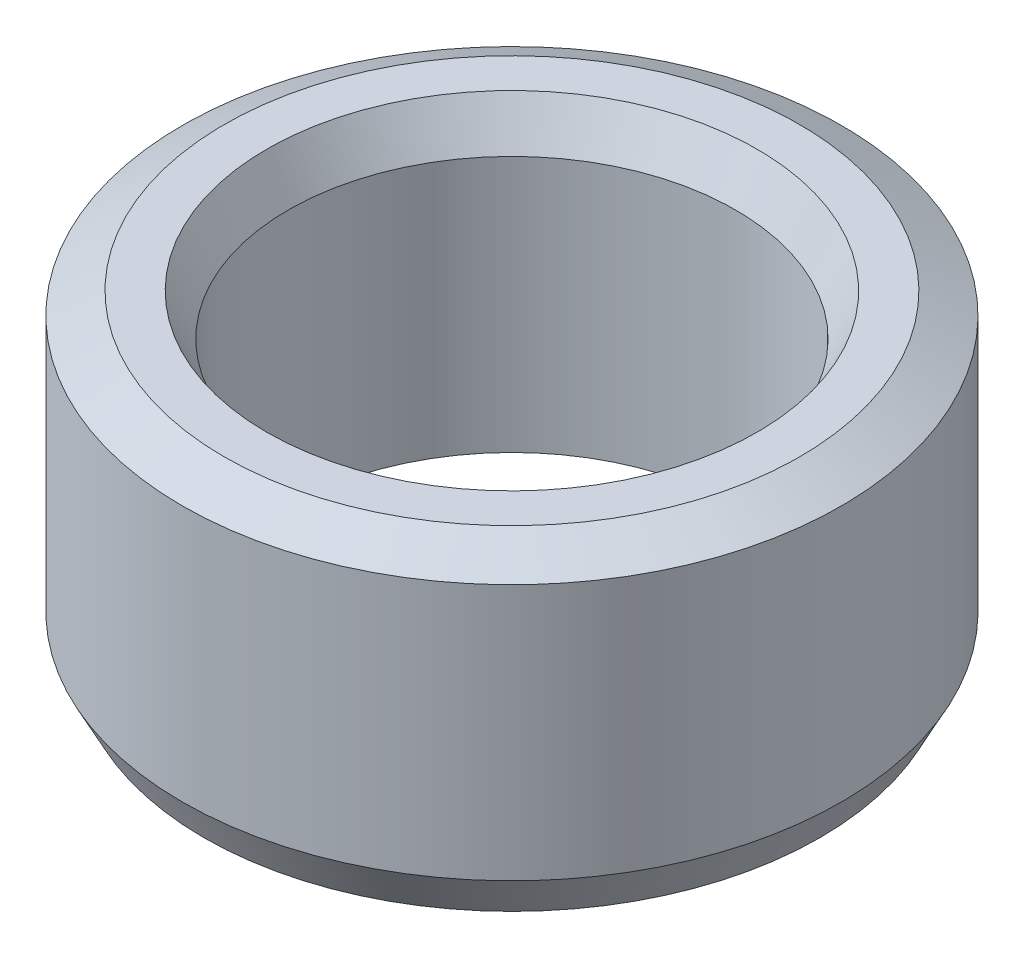
ISO-10303-21;
HEADER;
FILE_DESCRIPTION(('STEP AP214'),'2;1');
FILE_NAME('part.step','',(''),(''),'','','');
FILE_SCHEMA(('AUTOMOTIVE_DESIGN { 1 0 10303 214 1 1 1 1 }'));
ENDSEC;
DATA;
#1=APPLICATION_CONTEXT('core data for automotive mechanical design processes');
#2=APPLICATION_PROTOCOL_DEFINITION('international standard','automotive_design',2000,#1);
#3=PRODUCT_CONTEXT('',#1,'mechanical');
#4=PRODUCT('Part','Part','',(#3));
#5=PRODUCT_RELATED_PRODUCT_CATEGORY('part','',(#4));
#6=PRODUCT_DEFINITION_FORMATION('','',#4);
#7=PRODUCT_DEFINITION_CONTEXT('part definition',#1,'design');
#8=PRODUCT_DEFINITION('design','',#6,#7);
#9=PRODUCT_DEFINITION_SHAPE('','',#8);
#10=(LENGTH_UNIT() NAMED_UNIT(*) SI_UNIT(.MILLI.,.METRE.));
#11=(NAMED_UNIT(*) PLANE_ANGLE_UNIT() SI_UNIT($,.RADIAN.));
#12=(NAMED_UNIT(*) SI_UNIT($,.STERADIAN.) SOLID_ANGLE_UNIT());
#13=UNCERTAINTY_MEASURE_WITH_UNIT(LENGTH_MEASURE(1.E-05),#10,'distance_accuracy_value','');
#14=(GEOMETRIC_REPRESENTATION_CONTEXT(3) GLOBAL_UNCERTAINTY_ASSIGNED_CONTEXT((#13)) GLOBAL_UNIT_ASSIGNED_CONTEXT((#10,
#11,#12)) REPRESENTATION_CONTEXT('',''));
#15=CARTESIAN_POINT('',(0.,0.,0.));
#16=DIRECTION('',(0.,0.,1.));
#17=DIRECTION('',(1.,0.,0.));
#18=AXIS2_PLACEMENT_3D('',#15,#16,#17);
#19=CARTESIAN_POINT('',(0.,58.2230854384388,0.));
#20=DIRECTION('',(0.,-1.,0.));
#21=DIRECTION('',(0.,0.,-1.));
#22=AXIS2_PLACEMENT_3D('',#19,#20,#21);
#23=CYLINDRICAL_SURFACE('',#22,60.);
#24=CARTESIAN_POINT('',(0.,7.60752292098332,0.));
#25=DIRECTION('',(0.,1.,0.));
#26=DIRECTION('',(0.,0.,1.));
#27=AXIS2_PLACEMENT_3D('',#24,#25,#26);
#28=CIRCLE('',#27,60.);
#29=CARTESIAN_POINT('',(0.,7.60752292098332,60.));
#30=VERTEX_POINT('',#29);
#31=EDGE_CURVE('E10',#30,#30,#28,.T.);
#32=ORIENTED_EDGE('',*,*,#31,.T.);
#33=EDGE_LOOP('',(#32));
#34=FACE_BOUND('',#33,.T.);
#35=CARTESIAN_POINT('',(0.,54.2883937381654,0.));
#36=DIRECTION('',(0.,1.,0.));
#37=DIRECTION('',(0.,0.,1.));
#38=AXIS2_PLACEMENT_3D('',#35,#36,#37);
#39=CIRCLE('',#38,60.);
#40=CARTESIAN_POINT('',(0.,54.2883937381654,60.));
#41=VERTEX_POINT('',#40);
#42=EDGE_CURVE('E50',#41,#41,#39,.F.);
#43=ORIENTED_EDGE('',*,*,#42,.T.);
#44=EDGE_LOOP('',(#43));
#45=FACE_BOUND('',#44,.T.);
#46=ADVANCED_FACE('F39',(#34,#45),#23,.T.);
#47=CARTESIAN_POINT('',(0.,58.2230854384388,0.));
#48=DIRECTION('',(0.,1.,0.));
#49=DIRECTION('',(0.,0.,1.));
#50=AXIS2_PLACEMENT_3D('',#47,#48,#49);
#51=PLANE('',#50);
#52=CARTESIAN_POINT('',(0.,58.2230854384388,0.));
#53=DIRECTION('',(0.,1.,0.));
#54=DIRECTION('',(0.,0.,1.));
#55=AXIS2_PLACEMENT_3D('',#52,#53,#54);
#56=CIRCLE('',#55,44.6376050053237);
#57=CARTESIAN_POINT('',(0.,58.2230854384388,44.6376050053237));
#58=VERTEX_POINT('',#57);
#59=EDGE_CURVE('E58',#58,#58,#56,.F.);
#60=ORIENTED_EDGE('',*,*,#59,.T.);
#61=EDGE_LOOP('',(#60));
#62=FACE_BOUND('',#61,.T.);
#63=CARTESIAN_POINT('',(0.,58.2230854384388,0.));
#64=DIRECTION('',(0.,1.,0.));
#65=DIRECTION('',(0.,0.,1.));
#66=AXIS2_PLACEMENT_3D('',#63,#64,#65);
#67=CIRCLE('',#66,52.3924770790166);
#68=CARTESIAN_POINT('',(0.,58.2230854384388,52.3924770790166));
#69=VERTEX_POINT('',#68);
#70=EDGE_CURVE('E61',#69,#69,#67,.T.);
#71=ORIENTED_EDGE('',*,*,#70,.T.);
#72=EDGE_LOOP('',(#71));
#73=FACE_BOUND('',#72,.T.);
#74=ADVANCED_FACE('F88',(#62,#73),#51,.T.);
#75=CARTESIAN_POINT('',(0.,0.,0.));
#76=DIRECTION('',(0.,1.,0.));
#77=DIRECTION('',(0.,0.,1.));
#78=AXIS2_PLACEMENT_3D('',#75,#76,#77);
#79=PLANE('',#78);
#80=CARTESIAN_POINT('',(0.,0.,0.));
#81=DIRECTION('',(0.,1.,0.));
#82=DIRECTION('',(0.,0.,1.));
#83=AXIS2_PLACEMENT_3D('',#80,#81,#82);
#84=CIRCLE('',#83,48.3104362260336);
#85=CARTESIAN_POINT('',(0.,0.,48.3104362260336));
#86=VERTEX_POINT('',#85);
#87=EDGE_CURVE('E51',#86,#86,#84,.T.);
#88=ORIENTED_EDGE('',*,*,#87,.T.);
#89=EDGE_LOOP('',(#88));
#90=FACE_BOUND('',#89,.T.);
#91=CARTESIAN_POINT('',(0.,0.,0.));
#92=DIRECTION('',(0.,1.,0.));
#93=DIRECTION('',(0.,0.,1.));
#94=AXIS2_PLACEMENT_3D('',#91,#92,#93);
#95=CIRCLE('',#94,56.0653082997265);
#96=CARTESIAN_POINT('',(0.,0.,56.0653082997265));
#97=VERTEX_POINT('',#96);
#98=EDGE_CURVE('E54',#97,#97,#95,.F.);
#99=ORIENTED_EDGE('',*,*,#98,.T.);
#100=EDGE_LOOP('',(#99));
#101=FACE_BOUND('',#100,.T.);
#102=ADVANCED_FACE('F83',(#90,#101),#79,.F.);
#103=CARTESIAN_POINT('',(0.,58.2230854384388,0.));
#104=DIRECTION('',(0.,-1.,0.));
#105=DIRECTION('',(0.,0.,-1.));
#106=AXIS2_PLACEMENT_3D('',#103,#104,#105);
#107=CYLINDRICAL_SURFACE('',#106,40.7029133050503);
#108=CARTESIAN_POINT('',(0.,50.6155625174555,0.));
#109=DIRECTION('',(0.,1.,0.));
#110=DIRECTION('',(0.,0.,1.));
#111=AXIS2_PLACEMENT_3D('',#108,#109,#110);
#112=CIRCLE('',#111,40.7029133050503);
#113=CARTESIAN_POINT('',(0.,50.6155625174555,40.7029133050503));
#114=VERTEX_POINT('',#113);
#115=EDGE_CURVE('E67',#114,#114,#112,.T.);
#116=ORIENTED_EDGE('',*,*,#115,.T.);
#117=EDGE_LOOP('',(#116));
#118=FACE_BOUND('',#117,.T.);
#119=CARTESIAN_POINT('',(0.,3.93469170027348,0.));
#120=DIRECTION('',(0.,1.,0.));
#121=DIRECTION('',(0.,0.,1.));
#122=AXIS2_PLACEMENT_3D('',#119,#120,#121);
#123=CIRCLE('',#122,40.7029133050503);
#124=CARTESIAN_POINT('',(0.,3.93469170027348,40.7029133050503));
#125=VERTEX_POINT('',#124);
#126=EDGE_CURVE('E69',#125,#125,#123,.F.);
#127=ORIENTED_EDGE('',*,*,#126,.T.);
#128=EDGE_LOOP('',(#127));
#129=FACE_BOUND('',#128,.T.);
#130=ADVANCED_FACE('F71',(#118,#129),#107,.F.);
#131=CARTESIAN_POINT('',(0.,50.6155625174555,0.));
#132=DIRECTION('',(0.,1.,0.));
#133=DIRECTION('',(0.,0.,1.));
#134=AXIS2_PLACEMENT_3D('',#131,#132,#133);
#135=CONICAL_SURFACE('',#134,40.7029133050503,0.477321120672071);
#136=ORIENTED_EDGE('',*,*,#59,.F.);
#137=EDGE_LOOP('',(#136));
#138=FACE_BOUND('',#137,.T.);
#139=ORIENTED_EDGE('',*,*,#115,.F.);
#140=EDGE_LOOP('',(#139));
#141=FACE_BOUND('',#140,.T.);
#142=ADVANCED_FACE('F77',(#138,#141),#135,.F.);
#143=CARTESIAN_POINT('',(0.,0.,0.));
#144=DIRECTION('',(0.,-1.,0.));
#145=DIRECTION('',(0.,0.,-1.));
#146=AXIS2_PLACEMENT_3D('',#143,#144,#145);
#147=CONICAL_SURFACE('',#146,48.3104362260336,1.09347520612282);
#148=ORIENTED_EDGE('',*,*,#126,.F.);
#149=EDGE_LOOP('',(#148));
#150=FACE_BOUND('',#149,.T.);
#151=ORIENTED_EDGE('',*,*,#87,.F.);
#152=EDGE_LOOP('',(#151));
#153=FACE_BOUND('',#152,.T.);
#154=ADVANCED_FACE('F73',(#150,#153),#147,.F.);
#155=CARTESIAN_POINT('',(0.,7.60752292098332,0.));
#156=DIRECTION('',(0.,1.,0.));
#157=DIRECTION('',(0.,0.,1.));
#158=AXIS2_PLACEMENT_3D('',#155,#156,#157);
#159=CONICAL_SURFACE('',#158,60.,0.477321120672073);
#160=ORIENTED_EDGE('',*,*,#98,.F.);
#161=EDGE_LOOP('',(#160));
#162=FACE_BOUND('',#161,.T.);
#163=ORIENTED_EDGE('',*,*,#31,.F.);
#164=EDGE_LOOP('',(#163));
#165=FACE_BOUND('',#164,.T.);
#166=ADVANCED_FACE('F76',(#162,#165),#159,.T.);
#167=CARTESIAN_POINT('',(0.,58.2230854384388,0.));
#168=DIRECTION('',(0.,-1.,0.));
#169=DIRECTION('',(0.,0.,-1.));
#170=AXIS2_PLACEMENT_3D('',#167,#168,#169);
#171=CONICAL_SURFACE('',#170,52.3924770790166,1.09347520612282);
#172=ORIENTED_EDGE('',*,*,#42,.F.);
#173=EDGE_LOOP('',(#172));
#174=FACE_BOUND('',#173,.T.);
#175=ORIENTED_EDGE('',*,*,#70,.F.);
#176=EDGE_LOOP('',(#175));
#177=FACE_BOUND('',#176,.T.);
#178=ADVANCED_FACE('F45',(#174,#177),#171,.T.);
#179=CLOSED_SHELL('',(#46,#74,#102,#130,#142,#154,#166,#178));
#180=MANIFOLD_SOLID_BREP('B2',#179);
#181=ADVANCED_BREP_SHAPE_REPRESENTATION('',(#18,#180),#14);
#182=SHAPE_DEFINITION_REPRESENTATION(#9,#181);
ENDSEC;
END-ISO-10303-21;
